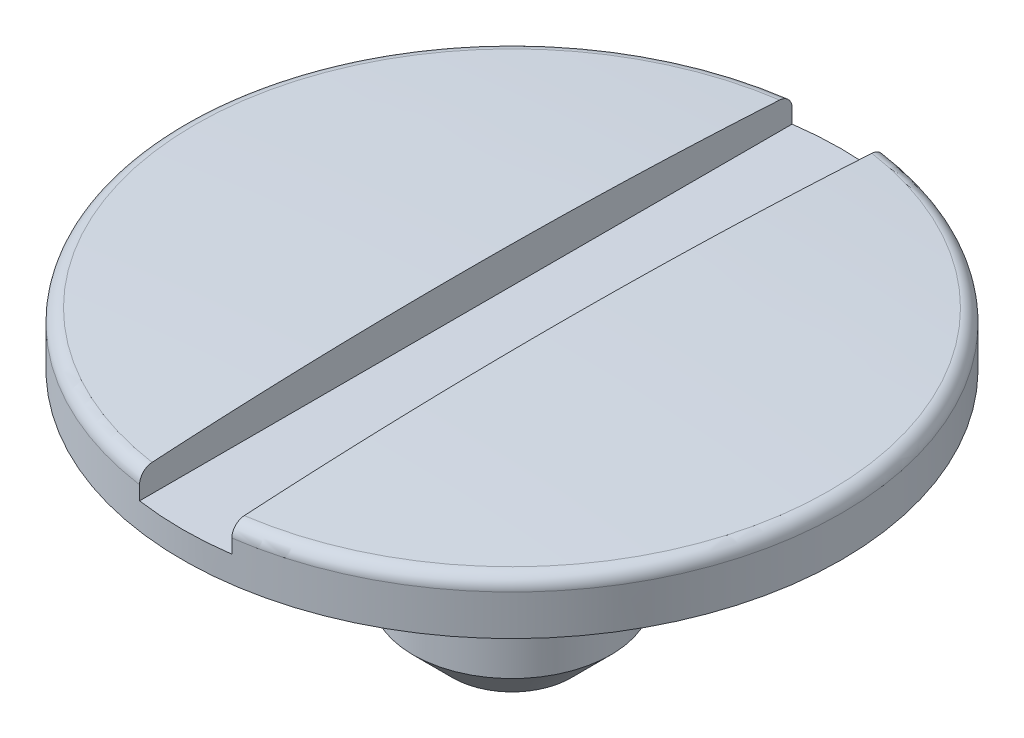
ISO-10303-21;
HEADER;
FILE_DESCRIPTION(('STEP AP214'),'2;1');
FILE_NAME('part.step','',(''),(''),'','','');
FILE_SCHEMA(('AUTOMOTIVE_DESIGN { 1 0 10303 214 1 1 1 1 }'));
ENDSEC;
DATA;
#1=APPLICATION_CONTEXT('core data for automotive mechanical design processes');
#2=APPLICATION_PROTOCOL_DEFINITION('international standard','automotive_design',2000,#1);
#3=PRODUCT_CONTEXT('',#1,'mechanical');
#4=PRODUCT('Part','Part','',(#3));
#5=PRODUCT_RELATED_PRODUCT_CATEGORY('part','',(#4));
#6=PRODUCT_DEFINITION_FORMATION('','',#4);
#7=PRODUCT_DEFINITION_CONTEXT('part definition',#1,'design');
#8=PRODUCT_DEFINITION('design','',#6,#7);
#9=PRODUCT_DEFINITION_SHAPE('','',#8);
#10=(LENGTH_UNIT() NAMED_UNIT(*) SI_UNIT(.MILLI.,.METRE.));
#11=(NAMED_UNIT(*) PLANE_ANGLE_UNIT() SI_UNIT($,.RADIAN.));
#12=(NAMED_UNIT(*) SI_UNIT($,.STERADIAN.) SOLID_ANGLE_UNIT());
#13=UNCERTAINTY_MEASURE_WITH_UNIT(LENGTH_MEASURE(1.E-05),#10,'distance_accuracy_value','');
#14=(GEOMETRIC_REPRESENTATION_CONTEXT(3) GLOBAL_UNCERTAINTY_ASSIGNED_CONTEXT((#13)) GLOBAL_UNIT_ASSIGNED_CONTEXT((#10,
#11,#12)) REPRESENTATION_CONTEXT('',''));
#15=CARTESIAN_POINT('',(0.,0.,0.));
#16=DIRECTION('',(0.,0.,1.));
#17=DIRECTION('',(1.,0.,0.));
#18=AXIS2_PLACEMENT_3D('',#15,#16,#17);
#19=CARTESIAN_POINT('',(0.,-19.7608992783391,0.));
#20=DIRECTION('',(0.,-1.,0.));
#21=DIRECTION('',(1.,0.,0.));
#22=AXIS2_PLACEMENT_3D('',#19,#20,#21);
#23=SPHERICAL_SURFACE('',#22,20.);
#24=CARTESIAN_POINT('',(0.175000000002915,-19.7608992783391,0.));
#25=DIRECTION('',(1.,1.44957830461334E-13,0.));
#26=DIRECTION('',(-1.44957830461334E-13,1.,0.));
#27=AXIS2_PLACEMENT_3D('',#24,#25,#26);
#28=CIRCLE('',#27,19.9992343603449);
#29=CARTESIAN_POINT('',(0.175000000000021,0.202887259031936,1.19021094360707));
#30=VERTEX_POINT('',#29);
#31=CARTESIAN_POINT('',(0.175000000000021,0.20288725903192,-1.19021094360705));
#32=VERTEX_POINT('',#31);
#33=EDGE_CURVE('E109',#30,#32,#28,.F.);
#34=ORIENTED_EDGE('',*,*,#33,.F.);
#35=CARTESIAN_POINT('',(0.,0.20288725903192,0.));
#36=DIRECTION('',(0.,-1.,0.));
#37=DIRECTION('',(1.,0.,0.));
#38=AXIS2_PLACEMENT_3D('',#35,#36,#37);
#39=CIRCLE('',#38,1.20300751879698);
#40=EDGE_CURVE('E126',#30,#32,#39,.F.);
#41=ORIENTED_EDGE('',*,*,#40,.T.);
#42=EDGE_LOOP('',(#34,#41));
#43=FACE_BOUND('',#42,.T.);
#44=ADVANCED_FACE('F35',(#43),#23,.T.);
#45=CARTESIAN_POINT('',(0.,0.152977792688504,0.));
#46=DIRECTION('',(0.,-1.,0.));
#47=DIRECTION('',(1.,0.,0.));
#48=AXIS2_PLACEMENT_3D('',#45,#46,#47);
#49=TOROIDAL_SURFACE('',#48,1.19999999999999,0.05);
#50=CARTESIAN_POINT('',(0.175000000000025,0.17814314222773,-1.23082680591107));
#51=CARTESIAN_POINT('',(0.175000000000025,0.175739905500405,-1.2322405294917));
#52=CARTESIAN_POINT('',(0.175000000000026,0.173216178275346,-1.23345323208134));
#53=CARTESIAN_POINT('',(0.175000000000026,0.167999042279667,-1.23543903077119));
#54=CARTESIAN_POINT('',(0.175000000000027,0.165305449265835,-1.23621164009273));
#55=CARTESIAN_POINT('',(0.175000000000028,0.159827143128158,-1.2372926322677));
#56=CARTESIAN_POINT('',(0.175000000000028,0.157042455136241,-1.23760114207482));
#57=CARTESIAN_POINT('',(0.175000000000029,0.151461597133707,-1.2377448150781));
#58=CARTESIAN_POINT('',(0.175000000000029,0.148665429969179,-1.2375800892728));
#59=CARTESIAN_POINT('',(0.17500000000003,0.143147372147493,-1.23678352501218));
#60=CARTESIAN_POINT('',(0.17500000000003,0.140425318686386,-1.23615281354743));
#61=CARTESIAN_POINT('',(0.175000000000031,0.135125276375744,-1.23444437488077));
#62=CARTESIAN_POINT('',(0.175000000000032,0.132547293015811,-1.23336663065843));
#63=CARTESIAN_POINT('',(0.175000000000032,0.127601602821766,-1.23079291282655));
#64=CARTESIAN_POINT('',(0.175000000000033,0.125234409789107,-1.22929595227378));
#65=CARTESIAN_POINT('',(0.175000000000033,0.12078250378857,-1.22592867308016));
#66=CARTESIAN_POINT('',(0.175000000000034,0.118697799879398,-1.22405834247103));
#67=CARTESIAN_POINT('',(0.175000000000034,0.114852733928691,-1.21998258574925));
#68=CARTESIAN_POINT('',(0.175000000000034,0.113094957819845,-1.21777472049145));
#69=CARTESIAN_POINT('',(0.175000000000035,0.10997072778715,-1.21309764262469));
#70=CARTESIAN_POINT('',(0.175000000000035,0.108604293347606,-1.21062841701138));
#71=CARTESIAN_POINT('',(0.175000000000035,0.106287317543209,-1.20547257145669));
#72=CARTESIAN_POINT('',(0.175000000000035,0.105341021513317,-1.20278404357694));
#73=CARTESIAN_POINT('',(0.175000000000036,0.10390908887247,-1.19728698062186));
#74=CARTESIAN_POINT('',(0.175000000000036,0.103423475727684,-1.19447843944093));
#75=CARTESIAN_POINT('',(0.175000000000036,0.10292339807145,-1.1887964310576));
#76=CARTESIAN_POINT('',(0.175000000000036,0.102912831778283,-1.18592262022366));
#77=CARTESIAN_POINT('',(0.175000000000036,0.103372780626638,-1.18021370376205));
#78=CARTESIAN_POINT('',(0.175000000000036,0.103843308635375,-1.17737859917166));
#79=CARTESIAN_POINT('',(0.175000000000035,0.105254872870065,-1.17181922954923));
#80=CARTESIAN_POINT('',(0.175000000000035,0.106197262490669,-1.16909530785792));
#81=CARTESIAN_POINT('',(0.175000000000035,0.108527808764417,-1.16384525549984));
#82=CARTESIAN_POINT('',(0.175000000000035,0.109915960321369,-1.16131912257226));
#83=CARTESIAN_POINT('',(0.175000000000034,0.113093474918537,-1.15654827306073));
#84=CARTESIAN_POINT('',(0.175000000000034,0.114881150677585,-1.15430243314902));
#85=CARTESIAN_POINT('',(0.175000000000034,0.118811557995639,-1.15014644626912));
#86=CARTESIAN_POINT('',(0.175000000000033,0.120954271895716,-1.14823628261476));
#87=CARTESIAN_POINT('',(0.175000000000033,0.125511815505933,-1.14482615187834));
#88=CARTESIAN_POINT('',(0.175000000000032,0.127923786414077,-1.14332236461102));
#89=CARTESIAN_POINT('',(0.175000000000031,0.132968119485738,-1.1407463118787));
#90=CARTESIAN_POINT('',(0.175000000000031,0.135600467266824,-1.13967401827967));
#91=CARTESIAN_POINT('',(0.17500000000003,0.140979729159952,-1.13800333856062));
#92=CARTESIAN_POINT('',(0.17500000000003,0.143725067383791,-1.13739987666341));
#93=CARTESIAN_POINT('',(0.175000000000029,0.149278223218668,-1.13666598742351));
#94=CARTESIAN_POINT('',(0.175000000000029,0.152086037836347,-1.13653553746684));
#95=CARTESIAN_POINT('',(0.175000000000028,0.157663884269895,-1.13675090442729));
#96=CARTESIAN_POINT('',(0.175000000000027,0.160434043122331,-1.13709344921361));
#97=CARTESIAN_POINT('',(0.175000000000027,0.165877528543119,-1.13823853381863));
#98=CARTESIAN_POINT('',(0.175000000000026,0.168550855810473,-1.13904107031607));
#99=CARTESIAN_POINT('',(0.175000000000026,0.173727083823367,-1.14108254823168));
#100=CARTESIAN_POINT('',(0.175000000000025,0.176229881007008,-1.14232175206551));
#101=CARTESIAN_POINT('',(0.175000000000024,0.180994053958628,-1.14519967292767));
#102=CARTESIAN_POINT('',(0.175000000000024,0.183255421943459,-1.14683840283026));
#103=CARTESIAN_POINT('',(0.175000000000024,0.187491676053976,-1.15048178126239));
#104=CARTESIAN_POINT('',(0.175000000000023,0.189464219116463,-1.15248915346659));
#105=CARTESIAN_POINT('',(0.175000000000023,0.193048781666998,-1.15680339712577));
#106=CARTESIAN_POINT('',(0.175000000000023,0.194660779956363,-1.15911028617863));
#107=CARTESIAN_POINT('',(0.175000000000022,0.197497287615949,-1.16398535938431));
#108=CARTESIAN_POINT('',(0.175000000000022,0.19871732236072,-1.16655614720435));
#109=CARTESIAN_POINT('',(0.175000000000022,0.200713020220241,-1.17186478734017));
#110=CARTESIAN_POINT('',(0.175000000000022,0.201488658153294,-1.17460264911344));
#111=CARTESIAN_POINT('',(0.175000000000021,0.202580164421022,-1.18019497700328));
#112=CARTESIAN_POINT('',(0.175000000000021,0.20289170240077,-1.18305028899713));
#113=CARTESIAN_POINT('',(0.175000000000021,0.2030328271899,-1.18877274111005));
#114=CARTESIAN_POINT('',(0.175000000000021,0.202862418528956,-1.1916398811177));
#115=CARTESIAN_POINT('',(0.175000000000021,0.202042574518601,-1.19731475821127));
#116=CARTESIAN_POINT('',(0.175000000000022,0.20139153119696,-1.20012226327418));
#117=CARTESIAN_POINT('',(0.175000000000022,0.199625487133099,-1.20558826277875));
#118=CARTESIAN_POINT('',(0.175000000000022,0.198510376093001,-1.20824672162511));
#119=CARTESIAN_POINT('',(0.175000000000022,0.195850721330959,-1.21332882778051));
#120=CARTESIAN_POINT('',(0.175000000000023,0.194307494446171,-1.21575316487769));
#121=CARTESIAN_POINT('',(0.175000000000023,0.190833580769013,-1.2203030972377));
#122=CARTESIAN_POINT('',(0.175000000000023,0.188903379291323,-1.22242906107655));
#123=CARTESIAN_POINT('',(0.175000000000024,0.185485435881591,-1.22560191479264));
#124=CARTESIAN_POINT('',(0.175000000000024,0.184097018869763,-1.22675762211436));
#125=CARTESIAN_POINT('',(0.175000000000024,0.181203606882909,-1.22891255829687));
#126=CARTESIAN_POINT('',(0.175000000000025,0.179698612448621,-1.22991178788341));
#127=CARTESIAN_POINT('',(0.175000000000025,0.17814314222773,-1.23082680591107));
#128=B_SPLINE_CURVE_WITH_KNOTS('',3,(#50,#51,#52,#53,#54,#55,#56,#57,#58,#59,#60,#61,#62,#63,
#64,#65,#66,#67,#68,#69,#70,#71,#72,#73,#74,#75,#76,#77,#78,#79,#80,#81,#82,#83,#84,#85,#86,#87,
#88,#89,#90,#91,#92,#93,#94,#95,#96,#97,#98,#99,#100,#101,#102,#103,#104,#105,#106,#107,#108,
#109,#110,#111,#112,#113,#114,#115,#116,#117,#118,#119,#120,#121,#122,#123,#124,#125,#126,#127),
.UNSPECIFIED.,.T.,.F.,(4,2,2,2,2,2,2,2,2,2,2,2,2,2,2,2,2,2,2,2,2,2,2,2,2,2,2,2,2,2,2,2,2,2,2,2,
2,2,4),(0.,0.00835811630492576,0.0167254594988953,0.0250905134030623,0.033453605423942,
0.0417965371680025,0.0501397865920968,0.0585028457319191,0.0668661729902605,0.0752930737976251,
0.0837203940945872,0.0922310320228593,0.100742103440928,0.109323003781775,0.117904133631021,
0.126510018109284,0.13511580420391,0.143685910772332,0.15225559120769,0.160741663175351,
0.169227181748551,0.177619500137894,0.186011417298041,0.194345569955071,0.20267966243782,
0.211018771867038,0.219358150049759,0.227761821285052,0.23616598649494,0.244662939148441,
0.253160373233218,0.261736607885834,0.270312761933227,0.278917738433751,0.287524761301972,
0.296105597976848,0.304675739777002,0.310085469566619,0.315495174264969),.UNSPECIFIED.);
#129=CARTESIAN_POINT('',(0.175000000000029,0.152977792687712,-1.23768937945401));
#130=VERTEX_POINT('',#129);
#131=EDGE_CURVE('E58',#32,#130,#128,.T.);
#132=ORIENTED_EDGE('',*,*,#131,.F.);
#133=ORIENTED_EDGE('',*,*,#40,.F.);
#134=CARTESIAN_POINT('',(0.175000000000026,0.168962621231855,1.13926164171563));
#135=CARTESIAN_POINT('',(0.175000000000027,0.166332896486868,1.138364086994));
#136=CARTESIAN_POINT('',(0.175000000000027,0.163625732418588,1.13768739558656));
#137=CARTESIAN_POINT('',(0.175000000000028,0.158134066430166,1.13679775253249));
#138=CARTESIAN_POINT('',(0.175000000000028,0.155349481369796,1.13658532058602));
#139=CARTESIAN_POINT('',(0.175000000000029,0.149785145247274,1.13663167335984));
#140=CARTESIAN_POINT('',(0.175000000000029,0.147005392662021,1.13689026320181));
#141=CARTESIAN_POINT('',(0.17500000000003,0.141529518716016,1.1378704169784));
#142=CARTESIAN_POINT('',(0.175000000000031,0.138833378619853,1.13859187639846));
#143=CARTESIAN_POINT('',(0.175000000000031,0.133599226514591,1.14047607827567));
#144=CARTESIAN_POINT('',(0.175000000000032,0.131061258081571,1.14163894171883));
#145=CARTESIAN_POINT('',(0.175000000000032,0.126214587735379,1.14437136595702));
#146=CARTESIAN_POINT('',(0.175000000000033,0.123905900386763,1.14594095256537));
#147=CARTESIAN_POINT('',(0.175000000000033,0.119565185694681,1.14945361864336));
#148=CARTESIAN_POINT('',(0.175000000000034,0.117535260884646,1.15139929558605));
#149=CARTESIAN_POINT('',(0.175000000000034,0.113826542000874,1.15560054969455));
#150=CARTESIAN_POINT('',(0.175000000000034,0.112147767099567,1.15785614377038));
#151=CARTESIAN_POINT('',(0.175000000000035,0.109169492472976,1.16263963332469));
#152=CARTESIAN_POINT('',(0.175000000000035,0.107874348070369,1.16517024057193));
#153=CARTESIAN_POINT('',(0.175000000000035,0.105722636469327,1.17041150006758));
#154=CARTESIAN_POINT('',(0.175000000000036,0.104866093118349,1.17312216209679));
#155=CARTESIAN_POINT('',(0.175000000000036,0.10360809447498,1.17867458271913));
#156=CARTESIAN_POINT('',(0.175000000000036,0.103211092309524,1.18151735091994));
#157=CARTESIAN_POINT('',(0.175000000000036,0.102897814054339,1.18722930178068));
#158=CARTESIAN_POINT('',(0.175000000000036,0.102981553848703,1.19009848531025));
#159=CARTESIAN_POINT('',(0.175000000000036,0.10362913699815,1.19579411411398));
#160=CARTESIAN_POINT('',(0.175000000000036,0.1041949384703,1.19862033715946));
#161=CARTESIAN_POINT('',(0.175000000000035,0.105794352571178,1.20413723120348));
#162=CARTESIAN_POINT('',(0.175000000000035,0.106827962333496,1.20682790303248));
#163=CARTESIAN_POINT('',(0.175000000000035,0.109331457551077,1.21198834282106));
#164=CARTESIAN_POINT('',(0.175000000000035,0.11080005666214,1.21445873455092));
#165=CARTESIAN_POINT('',(0.175000000000034,0.114134435107907,1.21911518472591));
#166=CARTESIAN_POINT('',(0.175000000000034,0.116000198532826,1.22130125455488));
#167=CARTESIAN_POINT('',(0.175000000000033,0.120059672861898,1.22530723821031));
#168=CARTESIAN_POINT('',(0.175000000000033,0.122250529505206,1.22713004399245));
#169=CARTESIAN_POINT('',(0.175000000000032,0.126909760553188,1.23037755195274));
#170=CARTESIAN_POINT('',(0.175000000000032,0.12937811942968,1.23180227639079));
#171=CARTESIAN_POINT('',(0.175000000000031,0.134495878900363,1.23419838824737));
#172=CARTESIAN_POINT('',(0.175000000000031,0.137143234991527,1.235174143036));
#173=CARTESIAN_POINT('',(0.17500000000003,0.142564876681444,1.23666357921331));
#174=CARTESIAN_POINT('',(0.17500000000003,0.145339156261432,1.23717728248885));
#175=CARTESIAN_POINT('',(0.175000000000029,0.150913750268948,1.23772496175193));
#176=CARTESIAN_POINT('',(0.175000000000028,0.153713717217984,1.23776247996777));
#177=CARTESIAN_POINT('',(0.175000000000028,0.159279991609768,1.23736582873857));
#178=CARTESIAN_POINT('',(0.175000000000027,0.162046299747994,1.2369316690564));
#179=CARTESIAN_POINT('',(0.175000000000026,0.167461018637976,1.23560609372201));
#180=CARTESIAN_POINT('',(0.175000000000026,0.170109658697451,1.2347156140107));
#181=CARTESIAN_POINT('',(0.175000000000025,0.175220716526529,1.23250437835022));
#182=CARTESIAN_POINT('',(0.175000000000025,0.17768313184486,1.23118361673847));
#183=CARTESIAN_POINT('',(0.175000000000024,0.182363105645333,1.22814432172208));
#184=CARTESIAN_POINT('',(0.175000000000024,0.184579623964319,1.22642418716525));
#185=CARTESIAN_POINT('',(0.175000000000023,0.188695499589535,1.22263912659818));
#186=CARTESIAN_POINT('',(0.175000000000023,0.190594844410042,1.22057418702088));
#187=CARTESIAN_POINT('',(0.175000000000023,0.194040202605224,1.21613932025284));
#188=CARTESIAN_POINT('',(0.175000000000022,0.195583028489057,1.21376691705355));
#189=CARTESIAN_POINT('',(0.175000000000022,0.19825300645526,1.20879874463916));
#190=CARTESIAN_POINT('',(0.175000000000022,0.199380135627918,1.20620296312303));
#191=CARTESIAN_POINT('',(0.175000000000022,0.201198111405696,1.20083438369371));
#192=CARTESIAN_POINT('',(0.175000000000021,0.201884563796938,1.19806009745953));
#193=CARTESIAN_POINT('',(0.175000000000021,0.202785568944092,1.19243589974792));
#194=CARTESIAN_POINT('',(0.175000000000021,0.203000099448436,1.18958598471092));
#195=CARTESIAN_POINT('',(0.175000000000021,0.202951647297774,1.1838701446225));
#196=CARTESIAN_POINT('',(0.175000000000021,0.202685304352978,1.18100424750469));
#197=CARTESIAN_POINT('',(0.175000000000022,0.201675796277346,1.17535774319161));
#198=CARTESIAN_POINT('',(0.175000000000022,0.200932641269928,1.17257713418686));
#199=CARTESIAN_POINT('',(0.175000000000022,0.198988705581178,1.16717811118463));
#200=CARTESIAN_POINT('',(0.175000000000022,0.197787552326618,1.16455983126027));
#201=CARTESIAN_POINT('',(0.175000000000022,0.19495978494279,1.15956305405676));
#202=CARTESIAN_POINT('',(0.175000000000023,0.193333075051756,1.15718461091449));
#203=CARTESIAN_POINT('',(0.175000000000023,0.18970971207351,1.15275095708176));
#204=CARTESIAN_POINT('',(0.175000000000024,0.1877151698206,1.15069401994406));
#205=CARTESIAN_POINT('',(0.175000000000024,0.183407205227854,1.14695068009784));
#206=CARTESIAN_POINT('',(0.175000000000024,0.181094191638515,1.14526380950149));
#207=CARTESIAN_POINT('',(0.175000000000025,0.177127573595874,1.14286179158345));
#208=CARTESIAN_POINT('',(0.175000000000025,0.175549849871734,1.14201889299311));
#209=CARTESIAN_POINT('',(0.175000000000026,0.172312966731991,1.14050742906273));
#210=CARTESIAN_POINT('',(0.175000000000026,0.17065380776687,1.13983886275846));
#211=CARTESIAN_POINT('',(0.175000000000026,0.168962621231855,1.13926164171563));
#212=B_SPLINE_CURVE_WITH_KNOTS('',3,(#134,#135,#136,#137,#138,#139,#140,#141,#142,#143,#144,
#145,#146,#147,#148,#149,#150,#151,#152,#153,#154,#155,#156,#157,#158,#159,#160,#161,#162,#163,
#164,#165,#166,#167,#168,#169,#170,#171,#172,#173,#174,#175,#176,#177,#178,#179,#180,#181,#182,
#183,#184,#185,#186,#187,#188,#189,#190,#191,#192,#193,#194,#195,#196,#197,#198,#199,#200,#201,
#202,#203,#204,#205,#206,#207,#208,#209,#210,#211),.UNSPECIFIED.,.T.,.F.,(4,2,2,2,2,2,2,2,2,2,2,
2,2,2,2,2,2,2,2,2,2,2,2,2,2,2,2,2,2,2,2,2,2,2,2,2,2,2,4),(0.,0.00832953819750837,
0.0166683958600939,0.0250038042271148,0.0333373311462398,0.0416731438832085,0.050009485795365,
0.0584056045030195,0.0668021815106784,0.0752907206169322,0.0837797212099689,0.0923503123881952,
0.10092118674713,0.109527042582271,0.118132845687299,0.126713449684738,0.135293710021163,
0.143802664212371,0.152311142505107,0.160735007124411,0.169158472693773,0.177519241046338,
0.185879836349622,0.194223351779319,0.202566977015342,0.21094464918368,0.219322651066344,
0.227772885302382,0.236223585174793,0.24475729354425,0.253291404277593,0.261885381404923,
0.270479176075584,0.279079976608069,0.287682714220858,0.296237539413706,0.304781485301365,
0.310138274366851,0.315495033803127),.UNSPECIFIED.);
#213=CARTESIAN_POINT('',(0.175000000000029,0.152977792688512,1.23768937944876));
#214=VERTEX_POINT('',#213);
#215=EDGE_CURVE('E160',#214,#30,#212,.T.);
#216=ORIENTED_EDGE('',*,*,#215,.F.);
#217=CARTESIAN_POINT('',(0.,0.152977792688525,0.));
#218=DIRECTION('',(0.,-1.,0.));
#219=DIRECTION('',(1.,0.,0.));
#220=AXIS2_PLACEMENT_3D('',#217,#218,#219);
#221=CIRCLE('',#220,1.24999999999999);
#222=EDGE_CURVE('E123',#130,#214,#221,.T.);
#223=ORIENTED_EDGE('',*,*,#222,.F.);
#224=EDGE_LOOP('',(#132,#133,#216,#223));
#225=FACE_BOUND('',#224,.T.);
#226=ADVANCED_FACE('F176',(#225),#49,.T.);
#227=CARTESIAN_POINT('',(-0.175000000002915,-19.7608992783391,0.));
#228=DIRECTION('',(-1.,1.44957830461334E-13,0.));
#229=DIRECTION('',(-1.44957830461334E-13,-1.,0.));
#230=AXIS2_PLACEMENT_3D('',#227,#228,#229);
#231=CIRCLE('',#230,19.9992343603449);
#232=CARTESIAN_POINT('',(-0.175000000000021,0.202887259031919,-1.19021094360706));
#233=VERTEX_POINT('',#232);
#234=CARTESIAN_POINT('',(-0.175000000000021,0.202887259031919,1.19021094360709));
#235=VERTEX_POINT('',#234);
#236=EDGE_CURVE('E50',#233,#235,#231,.F.);
#237=ORIENTED_EDGE('',*,*,#236,.F.);
#238=EDGE_CURVE('E129',#233,#235,#39,.F.);
#239=ORIENTED_EDGE('',*,*,#238,.T.);
#240=EDGE_LOOP('',(#237,#239));
#241=FACE_BOUND('',#240,.T.);
#242=ADVANCED_FACE('F171',(#241),#23,.T.);
#243=CARTESIAN_POINT('',(2.96201993591808E-12,-848.356227187947,0.));
#244=DIRECTION('',(0.,-1.,0.));
#245=DIRECTION('',(1.,0.,0.));
#246=AXIS2_PLACEMENT_3D('',#243,#244,#245);
#247=CYLINDRICAL_SURFACE('',#246,1.24999999999999);
#248=DIRECTION('',(0.,-1.,0.));
#249=VECTOR('',#248,1.);
#250=CARTESIAN_POINT('',(-0.175000000123027,-848.356227187947,-1.23768937943083));
#251=LINE('',#250,#249);
#252=CARTESIAN_POINT('',(-0.175000000000036,0.1,-1.23768937943083));
#253=VERTEX_POINT('',#252);
#254=CARTESIAN_POINT('',(-0.175000000000029,0.152977792689956,-1.2376893794487));
#255=VERTEX_POINT('',#254);
#256=EDGE_CURVE('E97',#253,#255,#251,.F.);
#257=ORIENTED_EDGE('',*,*,#256,.F.);
#258=CARTESIAN_POINT('',(0.,0.099999999999989,0.));
#259=DIRECTION('',(0.,-1.,0.));
#260=DIRECTION('',(0.,0.,-1.));
#261=AXIS2_PLACEMENT_3D('',#258,#259,#260);
#262=CIRCLE('',#261,1.24999999999999);
#263=CARTESIAN_POINT('',(0.175000000000036,0.099999999999989,-1.23768937944864));
#264=VERTEX_POINT('',#263);
#265=EDGE_CURVE('E11',#264,#253,#262,.F.);
#266=ORIENTED_EDGE('',*,*,#265,.F.);
#267=DIRECTION('',(0.,-1.,0.));
#268=VECTOR('',#267,1.);
#269=CARTESIAN_POINT('',(0.175000000123027,-848.356227187947,-1.23768937943167));
#270=LINE('',#269,#268);
#271=EDGE_CURVE('E115',#130,#264,#270,.T.);
#272=ORIENTED_EDGE('',*,*,#271,.F.);
#273=ORIENTED_EDGE('',*,*,#222,.T.);
#274=DIRECTION('',(0.,-1.,0.));
#275=VECTOR('',#274,1.);
#276=CARTESIAN_POINT('',(0.175000000123027,-848.356227187947,1.23768937943167));
#277=LINE('',#276,#275);
#278=CARTESIAN_POINT('',(0.175000000000036,0.099999999999989,1.23768937944864));
#279=VERTEX_POINT('',#278);
#280=EDGE_CURVE('E107',#279,#214,#277,.F.);
#281=ORIENTED_EDGE('',*,*,#280,.F.);
#282=CARTESIAN_POINT('',(-0.175000000000036,0.1,1.23768937943083));
#283=VERTEX_POINT('',#282);
#284=EDGE_CURVE('E39',#283,#279,#262,.F.);
#285=ORIENTED_EDGE('',*,*,#284,.F.);
#286=DIRECTION('',(0.,-1.,0.));
#287=VECTOR('',#286,1.);
#288=CARTESIAN_POINT('',(-0.175000000123027,-848.356227187947,1.23768937943083));
#289=LINE('',#288,#287);
#290=CARTESIAN_POINT('',(-0.175000000000029,0.152977792688571,1.23768937944903));
#291=VERTEX_POINT('',#290);
#292=EDGE_CURVE('E100',#291,#283,#289,.T.);
#293=ORIENTED_EDGE('',*,*,#292,.F.);
#294=EDGE_CURVE('E106',#291,#255,#221,.T.);
#295=ORIENTED_EDGE('',*,*,#294,.T.);
#296=EDGE_LOOP('',(#257,#266,#272,#273,#281,#285,#293,#295));
#297=FACE_BOUND('',#296,.T.);
#298=CARTESIAN_POINT('',(0.,0.,0.));
#299=DIRECTION('',(0.,-1.,0.));
#300=DIRECTION('',(1.,0.,0.));
#301=AXIS2_PLACEMENT_3D('',#298,#299,#300);
#302=CIRCLE('',#301,1.25);
#303=CARTESIAN_POINT('',(1.25,0.,0.));
#304=VERTEX_POINT('',#303);
#305=EDGE_CURVE('E117',#304,#304,#302,.T.);
#306=ORIENTED_EDGE('',*,*,#305,.F.);
#307=EDGE_LOOP('',(#306));
#308=FACE_BOUND('',#307,.T.);
#309=ADVANCED_FACE('F103',(#297,#308),#247,.T.);
#310=CARTESIAN_POINT('',(0.,0.,0.));
#311=DIRECTION('',(0.,-1.,0.));
#312=DIRECTION('',(1.,0.,0.));
#313=AXIS2_PLACEMENT_3D('',#310,#311,#312);
#314=PLANE('',#313);
#315=CARTESIAN_POINT('',(0.,0.,0.));
#316=DIRECTION('',(0.,-1.,0.));
#317=DIRECTION('',(1.,0.,0.));
#318=AXIS2_PLACEMENT_3D('',#315,#316,#317);
#319=CIRCLE('',#318,0.375);
#320=CARTESIAN_POINT('',(0.375,0.,0.));
#321=VERTEX_POINT('',#320);
#322=EDGE_CURVE('E120',#321,#321,#319,.T.);
#323=ORIENTED_EDGE('',*,*,#322,.F.);
#324=EDGE_LOOP('',(#323));
#325=FACE_BOUND('',#324,.T.);
#326=ORIENTED_EDGE('',*,*,#305,.T.);
#327=EDGE_LOOP('',(#326));
#328=FACE_BOUND('',#327,.T.);
#329=ADVANCED_FACE('F188',(#325,#328),#314,.T.);
#330=CARTESIAN_POINT('',(0.,-0.9,0.));
#331=DIRECTION('',(0.,1.,0.));
#332=DIRECTION('',(0.,0.,1.));
#333=AXIS2_PLACEMENT_3D('',#330,#331,#332);
#334=CYLINDRICAL_SURFACE('',#333,0.375);
#335=CARTESIAN_POINT('',(0.,-0.75,0.));
#336=DIRECTION('',(0.,1.,0.));
#337=DIRECTION('',(0.,0.,1.));
#338=AXIS2_PLACEMENT_3D('',#335,#336,#337);
#339=CIRCLE('',#338,0.375);
#340=CARTESIAN_POINT('',(0.,-0.75,0.375));
#341=VERTEX_POINT('',#340);
#342=EDGE_CURVE('E130',#341,#341,#339,.T.);
#343=ORIENTED_EDGE('',*,*,#342,.T.);
#344=EDGE_LOOP('',(#343));
#345=FACE_BOUND('',#344,.T.);
#346=ORIENTED_EDGE('',*,*,#322,.T.);
#347=EDGE_LOOP('',(#346));
#348=FACE_BOUND('',#347,.T.);
#349=ADVANCED_FACE('F192',(#345,#348),#334,.T.);
#350=CARTESIAN_POINT('',(0.,-0.9,0.));
#351=DIRECTION('',(0.,1.,0.));
#352=DIRECTION('',(0.,0.,1.));
#353=AXIS2_PLACEMENT_3D('',#350,#351,#352);
#354=PLANE('',#353);
#355=CARTESIAN_POINT('',(0.,-0.9,0.));
#356=DIRECTION('',(0.,1.,0.));
#357=DIRECTION('',(0.,0.,1.));
#358=AXIS2_PLACEMENT_3D('',#355,#356,#357);
#359=CIRCLE('',#358,0.224999999999999);
#360=CARTESIAN_POINT('',(0.,-0.9,0.224999999999999));
#361=VERTEX_POINT('',#360);
#362=EDGE_CURVE('E133',#361,#361,#359,.F.);
#363=ORIENTED_EDGE('',*,*,#362,.T.);
#364=EDGE_LOOP('',(#363));
#365=FACE_BOUND('',#364,.T.);
#366=ADVANCED_FACE('F157',(#365),#354,.F.);
#367=CARTESIAN_POINT('',(-0.175000000000025,0.178143142227729,-1.23082680591107));
#368=CARTESIAN_POINT('',(-0.175000000000025,0.180575549323346,-1.22939562720563));
#369=CARTESIAN_POINT('',(-0.175000000000024,0.182888059336514,-1.22775638248299));
#370=CARTESIAN_POINT('',(-0.175000000000024,0.187206052972521,-1.22411052919492));
#371=CARTESIAN_POINT('',(-0.175000000000023,0.189211130362352,-1.22210344212645));
#372=CARTESIAN_POINT('',(-0.175000000000023,0.192855070125863,-1.21778350159849));
#373=CARTESIAN_POINT('',(-0.175000000000023,0.194494261439382,-1.2154709257825));
#374=CARTESIAN_POINT('',(-0.175000000000022,0.197363925910296,-1.21060575637309));
#375=CARTESIAN_POINT('',(-0.175000000000022,0.198594499017218,-1.2080532216708));
#376=CARTESIAN_POINT('',(-0.175000000000022,0.200622679804393,-1.20275994901074));
#377=CARTESIAN_POINT('',(-0.175000000000022,0.201417027347103,-1.20001796185927));
#378=CARTESIAN_POINT('',(-0.175000000000021,0.202537993964647,-1.19443985510579));
#379=CARTESIAN_POINT('',(-0.175000000000021,0.202864571871045,-1.19160372724091));
#380=CARTESIAN_POINT('',(-0.175000000000021,0.203042232047109,-1.18589518853996));
#381=CARTESIAN_POINT('',(-0.175000000000021,0.202889718763274,-1.18302266525815));
#382=CARTESIAN_POINT('',(-0.175000000000021,0.202105554654163,-1.17734372139575));
#383=CARTESIAN_POINT('',(-0.175000000000022,0.201473894345457,-1.17453730212466));
#384=CARTESIAN_POINT('',(-0.175000000000022,0.199746861751094,-1.16906547489223));
#385=CARTESIAN_POINT('',(-0.175000000000022,0.198650682906633,-1.16640032131409));
#386=CARTESIAN_POINT('',(-0.175000000000022,0.196024158391964,-1.16129321612321));
#387=CARTESIAN_POINT('',(-0.175000000000023,0.194493821726224,-1.15885125988271));
#388=CARTESIAN_POINT('',(-0.175000000000023,0.191050185197848,-1.15427437963129));
#389=CARTESIAN_POINT('',(-0.175000000000023,0.189138952523583,-1.15213790082106));
#390=CARTESIAN_POINT('',(-0.175000000000024,0.184981575591913,-1.14822025687352));
#391=CARTESIAN_POINT('',(-0.175000000000024,0.182735449175415,-1.14643907282028));
#392=CARTESIAN_POINT('',(-0.175000000000025,0.177996740342262,-1.14330247419012));
#393=CARTESIAN_POINT('',(-0.175000000000025,0.175506944061066,-1.14194285073456));
#394=CARTESIAN_POINT('',(-0.175000000000026,0.170332639753087,-1.13966610096793));
#395=CARTESIAN_POINT('',(-0.175000000000026,0.167648144397146,-1.13874894589108));
#396=CARTESIAN_POINT('',(-0.175000000000027,0.162191388456745,-1.13739278637282));
#397=CARTESIAN_POINT('',(-0.175000000000028,0.159420366604807,-1.13694879507498));
#398=CARTESIAN_POINT('',(-0.175000000000028,0.153843186499918,-1.1365353291169));
#399=CARTESIAN_POINT('',(-0.175000000000029,0.15103702972051,-1.13656583462264));
#400=CARTESIAN_POINT('',(-0.17500000000003,0.145486338602822,-1.1370988282007));
#401=CARTESIAN_POINT('',(-0.17500000000003,0.142741542262458,-1.13759859408662));
#402=CARTESIAN_POINT('',(-0.175000000000031,0.137374580528939,-1.13905100270639));
#403=CARTESIAN_POINT('',(-0.175000000000031,0.13475241510814,-1.14000364533814));
#404=CARTESIAN_POINT('',(-0.175000000000032,0.129699105218263,-1.14233551334086));
#405=CARTESIAN_POINT('',(-0.175000000000032,0.12726834087356,-1.14371556201373));
#406=CARTESIAN_POINT('',(-0.175000000000033,0.122670395198369,-1.14686085885564));
#407=CARTESIAN_POINT('',(-0.175000000000033,0.120503224123803,-1.1486261220052));
#408=CARTESIAN_POINT('',(-0.175000000000034,0.116473639674116,-1.1525075300558));
#409=CARTESIAN_POINT('',(-0.175000000000034,0.114614009624458,-1.15462656397249));
#410=CARTESIAN_POINT('',(-0.175000000000035,0.111272204544722,-1.15914382373927));
#411=CARTESIAN_POINT('',(-0.175000000000035,0.10979005154651,-1.16154206587374));
#412=CARTESIAN_POINT('',(-0.175000000000035,0.107228068458744,-1.16657823018353));
#413=CARTESIAN_POINT('',(-0.175000000000035,0.106152886066039,-1.16921851701852));
#414=CARTESIAN_POINT('',(-0.175000000000036,0.104456794743183,-1.1746411917585));
#415=CARTESIAN_POINT('',(-0.175000000000036,0.103835909621688,-1.17742358710289));
#416=CARTESIAN_POINT('',(-0.175000000000036,0.103061565848313,-1.18307684462304));
#417=CARTESIAN_POINT('',(-0.175000000000036,0.102912123169462,-1.18594825756556));
#418=CARTESIAN_POINT('',(-0.175000000000036,0.103096185294703,-1.19167561430154));
#419=CARTESIAN_POINT('',(-0.175000000000036,0.103429700650546,-1.19453155775566));
#420=CARTESIAN_POINT('',(-0.175000000000036,0.104572388713917,-1.20015353296349));
#421=CARTESIAN_POINT('',(-0.175000000000035,0.105382644156895,-1.20291934487861));
#422=CARTESIAN_POINT('',(-0.175000000000035,0.107458092400755,-1.20827474362492));
#423=CARTESIAN_POINT('',(-0.175000000000035,0.108723278942049,-1.21086433288024));
#424=CARTESIAN_POINT('',(-0.175000000000035,0.111667328355797,-1.21578050515555));
#425=CARTESIAN_POINT('',(-0.175000000000034,0.113344265868859,-1.21810824077702));
#426=CARTESIAN_POINT('',(-0.175000000000034,0.117068468944277,-1.22244583521537));
#427=CARTESIAN_POINT('',(-0.175000000000033,0.119115717977389,-1.22445570821287));
#428=CARTESIAN_POINT('',(-0.175000000000033,0.12350259855971,-1.22808071918545));
#429=CARTESIAN_POINT('',(-0.175000000000032,0.125839392782382,-1.22969929053787));
#430=CARTESIAN_POINT('',(-0.175000000000032,0.130753581885446,-1.23251657390054));
#431=CARTESIAN_POINT('',(-0.175000000000031,0.133330953684593,-1.23371532613632));
#432=CARTESIAN_POINT('',(-0.175000000000031,0.138626074880401,-1.23564710805452));
#433=CARTESIAN_POINT('',(-0.17500000000003,0.141342205880997,-1.23638457548397));
#434=CARTESIAN_POINT('',(-0.175000000000029,0.146860781409834,-1.23738998579637));
#435=CARTESIAN_POINT('',(-0.175000000000029,0.149663244113947,-1.23765782910984));
#436=CARTESIAN_POINT('',(-0.175000000000028,0.155256582819601,-1.2377155133866));
#437=CARTESIAN_POINT('',(-0.175000000000028,0.158047432519358,-1.23750810018374));
#438=CARTESIAN_POINT('',(-0.175000000000027,0.163552114923177,-1.23662715861416));
#439=CARTESIAN_POINT('',(-0.175000000000027,0.166266038739026,-1.2359542078963));
#440=CARTESIAN_POINT('',(-0.175000000000026,0.170509992029035,-1.23451425257767));
#441=CARTESIAN_POINT('',(-0.175000000000026,0.172088674711142,-1.23388646897783));
#442=CARTESIAN_POINT('',(-0.175000000000025,0.175173743526472,-1.23247314854079));
#443=CARTESIAN_POINT('',(-0.175000000000025,0.176680130003276,-1.23168761245337));
#444=CARTESIAN_POINT('',(-0.175000000000025,0.178143142227729,-1.23082680591107));
#445=B_SPLINE_CURVE_WITH_KNOTS('',3,(#367,#368,#369,#370,#371,#372,#373,#374,#375,#376,#377,
#378,#379,#380,#381,#382,#383,#384,#385,#386,#387,#388,#389,#390,#391,#392,#393,#394,#395,#396,
#397,#398,#399,#400,#401,#402,#403,#404,#405,#406,#407,#408,#409,#410,#411,#412,#413,#414,#415,
#416,#417,#418,#419,#420,#421,#422,#423,#424,#425,#426,#427,#428,#429,#430,#431,#432,#433,#434,
#435,#436,#437,#438,#439,#440,#441,#442,#443,#444),.UNSPECIFIED.,.T.,.F.,(4,2,2,2,2,2,2,2,2,2,2,
2,2,2,2,2,2,2,2,2,2,2,2,2,2,2,2,2,2,2,2,2,2,2,2,2,2,2,4),(0.,0.00846036110375399,
0.0169318069002417,0.0253956057231792,0.0338573327418993,0.0423814666082803,0.0509063506381523,
0.0594953658973049,0.0680845511573931,0.0766887116078011,0.0852926936203141,0.0938511931612089,
0.102409236925128,0.110878859636434,0.119347931646028,0.127726834294746,0.136105386705223,
0.144435633336362,0.152765878089582,0.161112270058837,0.169458986666808,0.177877536899222,
0.186296578377093,0.19480905760658,0.203321982923216,0.211907232290198,0.220492669232032,
0.229097680434738,0.237702573242011,0.24626797100851,0.254832986543767,0.263319875648496,
0.271805951348136,0.280209078524286,0.288613987111965,0.296970458176574,0.30531657890859,
0.310405229805072,0.315493856515784),.UNSPECIFIED.);
#446=EDGE_CURVE('E141',#255,#233,#445,.T.);
#447=ORIENTED_EDGE('',*,*,#446,.F.);
#448=ORIENTED_EDGE('',*,*,#294,.F.);
#449=CARTESIAN_POINT('',(-0.175000000000026,0.168962621231854,1.13926164171563));
#450=CARTESIAN_POINT('',(-0.175000000000026,0.171619298608665,1.14016866760114));
#451=CARTESIAN_POINT('',(-0.175000000000025,0.174200825029093,1.14130246821452));
#452=CARTESIAN_POINT('',(-0.175000000000025,0.179138209552519,1.14398966336834));
#453=CARTESIAN_POINT('',(-0.175000000000024,0.181493770584494,1.14554360028035));
#454=CARTESIAN_POINT('',(-0.175000000000024,0.185909230971956,1.14902269439483));
#455=CARTESIAN_POINT('',(-0.175000000000023,0.187969403373969,1.15094750486625));
#456=CARTESIAN_POINT('',(-0.175000000000023,0.191739893981765,1.15511260373892));
#457=CARTESIAN_POINT('',(-0.175000000000023,0.193450294953274,1.15735281729463));
#458=CARTESIAN_POINT('',(-0.175000000000022,0.196488848144086,1.16210468951705));
#459=CARTESIAN_POINT('',(-0.175000000000022,0.197813787790336,1.16461840228243));
#460=CARTESIAN_POINT('',(-0.175000000000022,0.200027606057088,1.16983114286844));
#461=CARTESIAN_POINT('',(-0.175000000000022,0.200916443260008,1.17253018826277));
#462=CARTESIAN_POINT('',(-0.175000000000021,0.202241030939449,1.17806514486935));
#463=CARTESIAN_POINT('',(-0.175000000000021,0.202672282563093,1.18090213336543));
#464=CARTESIAN_POINT('',(-0.175000000000021,0.203054667476824,1.18660832550124));
#465=CARTESIAN_POINT('',(-0.175000000000021,0.203005785373836,1.18947753017087));
#466=CARTESIAN_POINT('',(-0.175000000000021,0.202427677938896,1.19517977966673));
#467=CARTESIAN_POINT('',(-0.175000000000021,0.201896374557831,1.19801261424341));
#468=CARTESIAN_POINT('',(-0.175000000000022,0.200364471021113,1.20354848419674));
#469=CARTESIAN_POINT('',(-0.175000000000022,0.199363873916576,1.20625152041715));
#470=CARTESIAN_POINT('',(-0.175000000000022,0.196923595939702,1.21144276220235));
#471=CARTESIAN_POINT('',(-0.175000000000022,0.195485101593839,1.21393152526878));
#472=CARTESIAN_POINT('',(-0.175000000000023,0.192207441671929,1.21862960156763));
#473=CARTESIAN_POINT('',(-0.175000000000023,0.190368291324436,1.22083892541623));
#474=CARTESIAN_POINT('',(-0.175000000000024,0.186357266717666,1.22489573558997));
#475=CARTESIAN_POINT('',(-0.175000000000024,0.184188234919858,1.22674603186612));
#476=CARTESIAN_POINT('',(-0.175000000000025,0.179567669771341,1.23005181983616));
#477=CARTESIAN_POINT('',(-0.175000000000025,0.177116152299923,1.23150733370642));
#478=CARTESIAN_POINT('',(-0.175000000000026,0.172026468491998,1.2339670699495));
#479=CARTESIAN_POINT('',(-0.175000000000026,0.169390404488738,1.23497564300452));
#480=CARTESIAN_POINT('',(-0.175000000000027,0.163985613874717,1.23653207856722));
#481=CARTESIAN_POINT('',(-0.175000000000027,0.161216893632955,1.23707996316977));
#482=CARTESIAN_POINT('',(-0.175000000000028,0.155647945157295,1.23769601997612));
#483=CARTESIAN_POINT('',(-0.175000000000029,0.152848115953808,1.23776780409574));
#484=CARTESIAN_POINT('',(-0.175000000000029,0.147276363781461,1.23743910853205));
#485=CARTESIAN_POINT('',(-0.17500000000003,0.144504440206325,1.23703863913131));
#486=CARTESIAN_POINT('',(-0.175000000000031,0.139073579930674,1.23577893855551));
#487=CARTESIAN_POINT('',(-0.175000000000031,0.136414401565553,1.23492074839244));
#488=CARTESIAN_POINT('',(-0.175000000000032,0.131277065479285,1.23277178358385));
#489=CARTESIAN_POINT('',(-0.175000000000032,0.128798909863237,1.23148100390875));
#490=CARTESIAN_POINT('',(-0.175000000000033,0.1240831778672,1.22849894903601));
#491=CARTESIAN_POINT('',(-0.175000000000033,0.121846570633036,1.22680614176571));
#492=CARTESIAN_POINT('',(-0.175000000000034,0.117686290978674,1.22307197095389));
#493=CARTESIAN_POINT('',(-0.175000000000034,0.115762630927016,1.22103059364244));
#494=CARTESIAN_POINT('',(-0.175000000000034,0.112265099599474,1.21663890175148));
#495=CARTESIAN_POINT('',(-0.175000000000035,0.110694343605271,1.21428610647761));
#496=CARTESIAN_POINT('',(-0.175000000000035,0.107965628560108,1.20935224558779));
#497=CARTESIAN_POINT('',(-0.175000000000035,0.106807691594856,1.20677116776801));
#498=CARTESIAN_POINT('',(-0.175000000000036,0.104925708797047,1.20142674952334));
#499=CARTESIAN_POINT('',(-0.175000000000036,0.104206049743709,1.19866186406014));
#500=CARTESIAN_POINT('',(-0.175000000000036,0.103237447914804,1.19305081974928));
#501=CARTESIAN_POINT('',(-0.175000000000036,0.102988526355686,1.19020465724427));
#502=CARTESIAN_POINT('',(-0.175000000000036,0.102967665991419,1.18449011659447));
#503=CARTESIAN_POINT('',(-0.175000000000036,0.103199157148504,1.18162172537333));
#504=CARTESIAN_POINT('',(-0.175000000000036,0.104139752361193,1.17596427861253));
#505=CARTESIAN_POINT('',(-0.175000000000036,0.104848866186738,1.17317522469696));
#506=CARTESIAN_POINT('',(-0.175000000000035,0.106726784521666,1.16775265093908));
#507=CARTESIAN_POINT('',(-0.175000000000035,0.107896126741056,1.1651193171877));
#508=CARTESIAN_POINT('',(-0.175000000000035,0.110662797059714,1.16008789124417));
#509=CARTESIAN_POINT('',(-0.175000000000034,0.112260116437594,1.15768979425969));
#510=CARTESIAN_POINT('',(-0.175000000000034,0.115828316130352,1.15321250507785));
#511=CARTESIAN_POINT('',(-0.175000000000034,0.117796975860899,1.15113154375841));
#512=CARTESIAN_POINT('',(-0.175000000000033,0.122058950311244,1.14733406654466));
#513=CARTESIAN_POINT('',(-0.175000000000033,0.124352233840511,1.1456175156766));
#514=CARTESIAN_POINT('',(-0.175000000000032,0.129172306045607,1.14261715589033));
#515=CARTESIAN_POINT('',(-0.175000000000032,0.131696343141867,1.14132892645688));
#516=CARTESIAN_POINT('',(-0.175000000000031,0.136927201699862,1.13919933090401));
#517=CARTESIAN_POINT('',(-0.17500000000003,0.139634057899753,1.13835804998177));
#518=CARTESIAN_POINT('',(-0.17500000000003,0.145123736939138,1.13715483660427));
#519=CARTESIAN_POINT('',(-0.175000000000029,0.147905536816828,1.13678822109871));
#520=CARTESIAN_POINT('',(-0.175000000000028,0.15348867449651,1.13653067431366));
#521=CARTESIAN_POINT('',(-0.175000000000028,0.156289982931679,1.13663913831309));
#522=CARTESIAN_POINT('',(-0.175000000000027,0.160744212669421,1.13719123257036));
#523=CARTESIAN_POINT('',(-0.175000000000027,0.162416860007533,1.13748681807766));
#524=CARTESIAN_POINT('',(-0.175000000000027,0.165723033491384,1.13824785762363));
#525=CARTESIAN_POINT('',(-0.175000000000026,0.16735655990969,1.13871331047841));
#526=CARTESIAN_POINT('',(-0.175000000000026,0.168962621231854,1.13926164171563));
#527=B_SPLINE_CURVE_WITH_KNOTS('',3,(#449,#450,#451,#452,#453,#454,#455,#456,#457,#458,#459,
#460,#461,#462,#463,#464,#465,#466,#467,#468,#469,#470,#471,#472,#473,#474,#475,#476,#477,#478,
#479,#480,#481,#482,#483,#484,#485,#486,#487,#488,#489,#490,#491,#492,#493,#494,#495,#496,#497,
#498,#499,#500,#501,#502,#503,#504,#505,#506,#507,#508,#509,#510,#511,#512,#513,#514,#515,#516,
#517,#518,#519,#520,#521,#522,#523,#524,#525,#526),.UNSPECIFIED.,.T.,.F.,(4,2,2,2,2,2,2,2,2,2,2,
2,2,2,2,2,2,2,2,2,2,2,2,2,2,2,2,2,2,2,2,2,2,2,2,2,2,2,4),(0.,0.00841546303552065,
0.0168418422502915,0.0252603815045954,0.0336769263855684,0.0421617302463097,0.0506473397710986,
0.0592156255833645,0.0677841860955323,0.0763898320384991,0.084995422032575,0.0935778987949544,
0.102160049402465,0.110672052001497,0.119183576350779,0.127610321721292,0.136036662917456,
0.144399004187187,0.152761163383466,0.161104384793163,0.169447703210117,0.177823342037181,
0.18619931181231,0.194646545052057,0.203094230148751,0.211625136145926,0.220156426627505,
0.228748836737125,0.237341422612858,0.245944077621375,0.254546557336945,0.263099138346372,
0.271650898163067,0.280111441228021,0.28857359646073,0.296951611381724,0.305318965163187,
0.310406464309191,0.315493927998772),.UNSPECIFIED.);
#528=EDGE_CURVE('E136',#235,#291,#527,.T.);
#529=ORIENTED_EDGE('',*,*,#528,.F.);
#530=ORIENTED_EDGE('',*,*,#238,.F.);
#531=EDGE_LOOP('',(#447,#448,#529,#530));
#532=FACE_BOUND('',#531,.T.);
#533=ADVANCED_FACE('F145',(#532),#49,.T.);
#534=CARTESIAN_POINT('',(0.,-0.75,0.));
#535=DIRECTION('',(0.,1.,0.));
#536=DIRECTION('',(0.,0.,1.));
#537=AXIS2_PLACEMENT_3D('',#534,#535,#536);
#538=CONICAL_SURFACE('',#537,0.375,0.785398163397453);
#539=ORIENTED_EDGE('',*,*,#362,.F.);
#540=EDGE_LOOP('',(#539));
#541=FACE_BOUND('',#540,.T.);
#542=ORIENTED_EDGE('',*,*,#342,.F.);
#543=EDGE_LOOP('',(#542));
#544=FACE_BOUND('',#543,.T.);
#545=ADVANCED_FACE('F37',(#541,#544),#538,.T.);
#546=CARTESIAN_POINT('',(0.175,0.349999999999961,-1.25));
#547=DIRECTION('',(1.,1.44957830461334E-13,0.));
#548=DIRECTION('',(-1.44957830461334E-13,1.,0.));
#549=AXIS2_PLACEMENT_3D('',#546,#547,#548);
#550=PLANE('',#549);
#551=ORIENTED_EDGE('',*,*,#271,.T.);
#552=DIRECTION('',(0.,0.,1.));
#553=VECTOR('',#552,1.);
#554=CARTESIAN_POINT('',(0.175000000000036,0.1,-1.25));
#555=LINE('',#554,#553);
#556=EDGE_CURVE('E92',#264,#279,#555,.T.);
#557=ORIENTED_EDGE('',*,*,#556,.T.);
#558=ORIENTED_EDGE('',*,*,#280,.T.);
#559=ORIENTED_EDGE('',*,*,#215,.T.);
#560=ORIENTED_EDGE('',*,*,#33,.T.);
#561=ORIENTED_EDGE('',*,*,#131,.T.);
#562=EDGE_LOOP('',(#551,#557,#558,#559,#560,#561));
#563=FACE_BOUND('',#562,.T.);
#564=ADVANCED_FACE('F152',(#563),#550,.F.);
#565=CARTESIAN_POINT('',(0.175000000000036,0.1,-1.25));
#566=DIRECTION('',(0.,-1.,0.));
#567=DIRECTION('',(0.,0.,-1.));
#568=AXIS2_PLACEMENT_3D('',#565,#566,#567);
#569=PLANE('',#568);
#570=DIRECTION('',(0.,0.,1.));
#571=VECTOR('',#570,1.);
#572=CARTESIAN_POINT('',(-0.175000000000036,0.1,-1.25));
#573=LINE('',#572,#571);
#574=EDGE_CURVE('E90',#253,#283,#573,.T.);
#575=ORIENTED_EDGE('',*,*,#574,.T.);
#576=ORIENTED_EDGE('',*,*,#284,.T.);
#577=ORIENTED_EDGE('',*,*,#556,.F.);
#578=ORIENTED_EDGE('',*,*,#265,.T.);
#579=EDGE_LOOP('',(#575,#576,#577,#578));
#580=FACE_BOUND('',#579,.T.);
#581=ADVANCED_FACE('F89',(#580),#569,.F.);
#582=CARTESIAN_POINT('',(-0.175,0.349999999999961,-1.25));
#583=DIRECTION('',(-1.,1.44957830461334E-13,0.));
#584=DIRECTION('',(-1.44957830461334E-13,-1.,0.));
#585=AXIS2_PLACEMENT_3D('',#582,#583,#584);
#586=PLANE('',#585);
#587=ORIENTED_EDGE('',*,*,#256,.T.);
#588=ORIENTED_EDGE('',*,*,#446,.T.);
#589=ORIENTED_EDGE('',*,*,#236,.T.);
#590=ORIENTED_EDGE('',*,*,#528,.T.);
#591=ORIENTED_EDGE('',*,*,#292,.T.);
#592=ORIENTED_EDGE('',*,*,#574,.F.);
#593=EDGE_LOOP('',(#587,#588,#589,#590,#591,#592));
#594=FACE_BOUND('',#593,.T.);
#595=ADVANCED_FACE('F96',(#594),#586,.F.);
#596=CLOSED_SHELL('',(#44,#226,#242,#309,#329,#349,#366,#533,#545,#564,#581,#595));
#597=MANIFOLD_SOLID_BREP('B2',#596);
#598=ADVANCED_BREP_SHAPE_REPRESENTATION('',(#18,#597),#14);
#599=SHAPE_DEFINITION_REPRESENTATION(#9,#598);
ENDSEC;
END-ISO-10303-21;
